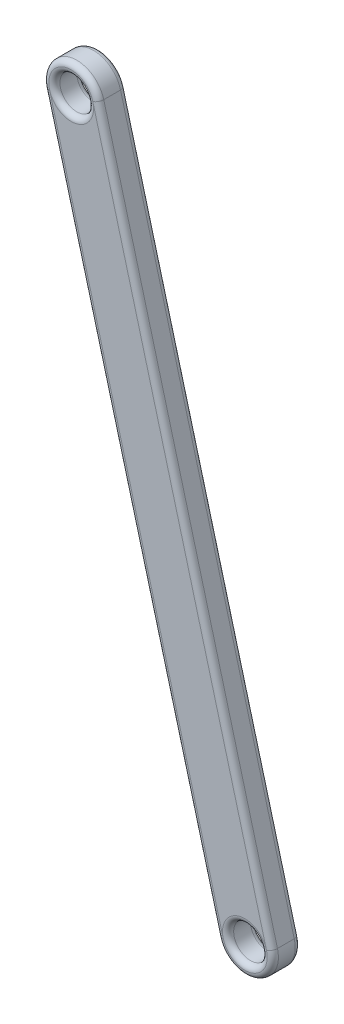
ISO-10303-21;
HEADER;
FILE_DESCRIPTION(('STEP AP214'),'2;1');
FILE_NAME('part.step','',(''),(''),'','','');
FILE_SCHEMA(('AUTOMOTIVE_DESIGN { 1 0 10303 214 1 1 1 1 }'));
ENDSEC;
DATA;
#1=APPLICATION_CONTEXT('core data for automotive mechanical design processes');
#2=APPLICATION_PROTOCOL_DEFINITION('international standard','automotive_design',2000,#1);
#3=PRODUCT_CONTEXT('',#1,'mechanical');
#4=PRODUCT('Part','Part','',(#3));
#5=PRODUCT_RELATED_PRODUCT_CATEGORY('part','',(#4));
#6=PRODUCT_DEFINITION_FORMATION('','',#4);
#7=PRODUCT_DEFINITION_CONTEXT('part definition',#1,'design');
#8=PRODUCT_DEFINITION('design','',#6,#7);
#9=PRODUCT_DEFINITION_SHAPE('','',#8);
#10=(LENGTH_UNIT() NAMED_UNIT(*) SI_UNIT(.MILLI.,.METRE.));
#11=(NAMED_UNIT(*) PLANE_ANGLE_UNIT() SI_UNIT($,.RADIAN.));
#12=(NAMED_UNIT(*) SI_UNIT($,.STERADIAN.) SOLID_ANGLE_UNIT());
#13=UNCERTAINTY_MEASURE_WITH_UNIT(LENGTH_MEASURE(1.E-05),#10,'distance_accuracy_value','');
#14=(GEOMETRIC_REPRESENTATION_CONTEXT(3) GLOBAL_UNCERTAINTY_ASSIGNED_CONTEXT((#13)) GLOBAL_UNIT_ASSIGNED_CONTEXT((#10,
#11,#12)) REPRESENTATION_CONTEXT('',''));
#15=CARTESIAN_POINT('',(0.,0.,0.));
#16=DIRECTION('',(0.,0.,1.));
#17=DIRECTION('',(1.,0.,0.));
#18=AXIS2_PLACEMENT_3D('',#15,#16,#17);
#19=CARTESIAN_POINT('',(27.373714942326,121.762953497462,2.5));
#20=DIRECTION('',(0.,0.,1.));
#21=DIRECTION('',(1.,0.,0.));
#22=AXIS2_PLACEMENT_3D('',#19,#20,#21);
#23=PLANE('',#22);
#24=DIRECTION('',(0.258819045102528,-0.965925826289067,0.));
#25=VECTOR('',#24,1.);
#26=CARTESIAN_POINT('',(40.9710059958995,63.2897658299125,2.5));
#27=LINE('',#26,#25);
#28=CARTESIAN_POINT('',(25.4418632897479,121.245315407256,2.5));
#29=VERTEX_POINT('',#28);
#30=CARTESIAN_POINT('',(40.9710059958995,63.2897658299125,2.5));
#31=VERTEX_POINT('',#30);
#32=EDGE_CURVE('E64',#29,#31,#27,.T.);
#33=ORIENTED_EDGE('',*,*,#32,.T.);
#34=CARTESIAN_POINT('',(42.9028576484777,63.8074039201176,2.5));
#35=DIRECTION('',(0.,0.,1.));
#36=DIRECTION('',(1.,0.,0.));
#37=AXIS2_PLACEMENT_3D('',#34,#35,#36);
#38=CIRCLE('',#37,2.);
#39=CARTESIAN_POINT('',(44.8347093010558,64.3250420103226,2.5));
#40=VERTEX_POINT('',#39);
#41=EDGE_CURVE('E11',#31,#40,#38,.F.);
#42=ORIENTED_EDGE('',*,*,#41,.T.);
#43=DIRECTION('',(-0.258819045102528,0.965925826289067,0.));
#44=VECTOR('',#43,1.);
#45=CARTESIAN_POINT('',(29.3055665949042,122.280591587667,2.5));
#46=LINE('',#45,#44);
#47=CARTESIAN_POINT('',(29.3055665949042,122.280591587667,2.5));
#48=VERTEX_POINT('',#47);
#49=EDGE_CURVE('E50',#40,#48,#46,.T.);
#50=ORIENTED_EDGE('',*,*,#49,.T.);
#51=CARTESIAN_POINT('',(27.373714942326,121.762953497462,2.5));
#52=DIRECTION('',(0.,0.,1.));
#53=DIRECTION('',(1.,0.,0.));
#54=AXIS2_PLACEMENT_3D('',#51,#52,#53);
#55=CIRCLE('',#54,2.00000000000001);
#56=CARTESIAN_POINT('',(29.373714942326,121.762953497462,2.5));
#57=VERTEX_POINT('',#56);
#58=EDGE_CURVE('E189',#48,#57,#55,.F.);
#59=ORIENTED_EDGE('',*,*,#58,.T.);
#60=CARTESIAN_POINT('',(27.373714942326,121.762953497462,2.5));
#61=DIRECTION('',(0.,0.,1.));
#62=DIRECTION('',(1.,0.,0.));
#63=AXIS2_PLACEMENT_3D('',#60,#61,#62);
#64=CIRCLE('',#63,2.00000000000001);
#65=EDGE_CURVE('E191',#57,#29,#64,.F.);
#66=ORIENTED_EDGE('',*,*,#65,.T.);
#67=EDGE_LOOP('',(#33,#42,#50,#59,#66));
#68=FACE_BOUND('',#67,.T.);
#69=ADVANCED_FACE('F41',(#68),#23,.T.);
#70=CARTESIAN_POINT('',(27.373714942326,121.762953497462,0.));
#71=DIRECTION('',(0.,0.,1.));
#72=DIRECTION('',(1.,0.,0.));
#73=AXIS2_PLACEMENT_3D('',#70,#71,#72);
#74=PLANE('',#73);
#75=DIRECTION('',(0.258819045102528,-0.965925826289067,0.));
#76=VECTOR('',#75,1.);
#77=CARTESIAN_POINT('',(25.4418632897479,121.245315407257,0.));
#78=LINE('',#77,#76);
#79=CARTESIAN_POINT('',(40.9710059958995,63.2897658299125,0.));
#80=VERTEX_POINT('',#79);
#81=CARTESIAN_POINT('',(25.4418632897479,121.245315407256,0.));
#82=VERTEX_POINT('',#81);
#83=EDGE_CURVE('E157',#80,#82,#78,.F.);
#84=ORIENTED_EDGE('',*,*,#83,.T.);
#85=CARTESIAN_POINT('',(27.373714942326,121.762953497462,0.));
#86=DIRECTION('',(0.,0.,1.));
#87=DIRECTION('',(1.,0.,0.));
#88=AXIS2_PLACEMENT_3D('',#85,#86,#87);
#89=CIRCLE('',#88,2.00000000000001);
#90=CARTESIAN_POINT('',(29.373714942326,121.762953497462,0.));
#91=VERTEX_POINT('',#90);
#92=EDGE_CURVE('E122',#82,#91,#89,.T.);
#93=ORIENTED_EDGE('',*,*,#92,.T.);
#94=CARTESIAN_POINT('',(27.373714942326,121.762953497462,0.));
#95=DIRECTION('',(0.,0.,1.));
#96=DIRECTION('',(1.,0.,0.));
#97=AXIS2_PLACEMENT_3D('',#94,#95,#96);
#98=CIRCLE('',#97,2.00000000000001);
#99=CARTESIAN_POINT('',(29.3055665949041,122.280591587667,0.));
#100=VERTEX_POINT('',#99);
#101=EDGE_CURVE('E114',#91,#100,#98,.T.);
#102=ORIENTED_EDGE('',*,*,#101,.T.);
#103=DIRECTION('',(-0.258819045102528,0.965925826289067,0.));
#104=VECTOR('',#103,1.);
#105=CARTESIAN_POINT('',(29.3055665949041,122.280591587667,0.));
#106=LINE('',#105,#104);
#107=CARTESIAN_POINT('',(44.8347093010558,64.3250420103226,0.));
#108=VERTEX_POINT('',#107);
#109=EDGE_CURVE('E119',#100,#108,#106,.F.);
#110=ORIENTED_EDGE('',*,*,#109,.T.);
#111=CARTESIAN_POINT('',(42.9028576484777,63.8074039201176,0.));
#112=DIRECTION('',(0.,0.,1.));
#113=DIRECTION('',(1.,0.,0.));
#114=AXIS2_PLACEMENT_3D('',#111,#112,#113);
#115=CIRCLE('',#114,2.);
#116=EDGE_CURVE('E124',#108,#80,#115,.T.);
#117=ORIENTED_EDGE('',*,*,#116,.T.);
#118=EDGE_LOOP('',(#84,#93,#102,#110,#117));
#119=FACE_BOUND('',#118,.T.);
#120=ADVANCED_FACE('F116',(#119),#74,.F.);
#121=CARTESIAN_POINT('',(27.373714942326,121.762953497462,2.5));
#122=DIRECTION('',(0.,0.,-1.));
#123=DIRECTION('',(-1.,0.,0.));
#124=AXIS2_PLACEMENT_3D('',#121,#122,#123);
#125=CYLINDRICAL_SURFACE('',#124,2.5);
#126=DIRECTION('',(0.,0.,-1.));
#127=VECTOR('',#126,1.);
#128=CARTESIAN_POINT('',(29.7885295080487,122.410001110218,2.5));
#129=LINE('',#128,#127);
#130=CARTESIAN_POINT('',(29.7885295080487,122.410001110218,2.));
#131=VERTEX_POINT('',#130);
#132=CARTESIAN_POINT('',(29.7885295080487,122.410001110218,0.5));
#133=VERTEX_POINT('',#132);
#134=EDGE_CURVE('E133',#131,#133,#129,.T.);
#135=ORIENTED_EDGE('',*,*,#134,.T.);
#136=CARTESIAN_POINT('',(27.373714942326,121.762953497462,0.5));
#137=DIRECTION('',(0.,0.,1.));
#138=DIRECTION('',(1.,0.,0.));
#139=AXIS2_PLACEMENT_3D('',#136,#137,#138);
#140=CIRCLE('',#139,2.5);
#141=CARTESIAN_POINT('',(24.9589003766033,121.115905884705,0.5));
#142=VERTEX_POINT('',#141);
#143=EDGE_CURVE('E140',#133,#142,#140,.T.);
#144=ORIENTED_EDGE('',*,*,#143,.T.);
#145=DIRECTION('',(0.,0.,-1.));
#146=VECTOR('',#145,1.);
#147=CARTESIAN_POINT('',(24.9589003766033,121.115905884705,2.5));
#148=LINE('',#147,#146);
#149=CARTESIAN_POINT('',(24.9589003766033,121.115905884705,2.));
#150=VERTEX_POINT('',#149);
#151=EDGE_CURVE('E149',#150,#142,#148,.T.);
#152=ORIENTED_EDGE('',*,*,#151,.F.);
#153=CARTESIAN_POINT('',(27.373714942326,121.762953497462,2.));
#154=DIRECTION('',(0.,0.,1.));
#155=DIRECTION('',(1.,0.,0.));
#156=AXIS2_PLACEMENT_3D('',#153,#154,#155);
#157=CIRCLE('',#156,2.5);
#158=EDGE_CURVE('E186',#150,#131,#157,.F.);
#159=ORIENTED_EDGE('',*,*,#158,.T.);
#160=EDGE_LOOP('',(#135,#144,#152,#159));
#161=FACE_BOUND('',#160,.T.);
#162=ADVANCED_FACE('F241',(#161),#125,.T.);
#163=CARTESIAN_POINT('',(24.9589003766033,121.115905884705,2.5));
#164=DIRECTION('',(0.965925826289067,0.258819045102528,0.));
#165=DIRECTION('',(-0.258819045102528,0.965925826289067,0.));
#166=AXIS2_PLACEMENT_3D('',#163,#164,#165);
#167=PLANE('',#166);
#168=ORIENTED_EDGE('',*,*,#151,.T.);
#169=DIRECTION('',(0.258819045102528,-0.965925826289067,0.));
#170=VECTOR('',#169,1.);
#171=CARTESIAN_POINT('',(24.9589003766033,121.115905884705,0.5));
#172=LINE('',#171,#170);
#173=CARTESIAN_POINT('',(40.488043082755,63.1603563073612,0.5));
#174=VERTEX_POINT('',#173);
#175=EDGE_CURVE('E174',#142,#174,#172,.T.);
#176=ORIENTED_EDGE('',*,*,#175,.T.);
#177=DIRECTION('',(0.,0.,-1.));
#178=VECTOR('',#177,1.);
#179=CARTESIAN_POINT('',(40.488043082755,63.1603563073612,2.5));
#180=LINE('',#179,#178);
#181=CARTESIAN_POINT('',(40.488043082755,63.1603563073612,2.));
#182=VERTEX_POINT('',#181);
#183=EDGE_CURVE('E152',#182,#174,#180,.T.);
#184=ORIENTED_EDGE('',*,*,#183,.F.);
#185=DIRECTION('',(0.258819045102528,-0.965925826289067,0.));
#186=VECTOR('',#185,1.);
#187=CARTESIAN_POINT('',(24.9589003766033,121.115905884705,2.));
#188=LINE('',#187,#186);
#189=EDGE_CURVE('E172',#182,#150,#188,.F.);
#190=ORIENTED_EDGE('',*,*,#189,.T.);
#191=EDGE_LOOP('',(#168,#176,#184,#190));
#192=FACE_BOUND('',#191,.T.);
#193=ADVANCED_FACE('F277',(#192),#167,.F.);
#194=CARTESIAN_POINT('',(42.9028576484777,63.8074039201176,2.5));
#195=DIRECTION('',(0.,0.,-1.));
#196=DIRECTION('',(-1.,0.,0.));
#197=AXIS2_PLACEMENT_3D('',#194,#195,#196);
#198=CYLINDRICAL_SURFACE('',#197,2.50000000000002);
#199=ORIENTED_EDGE('',*,*,#183,.T.);
#200=CARTESIAN_POINT('',(42.9028576484777,63.8074039201176,0.5));
#201=DIRECTION('',(0.,0.,1.));
#202=DIRECTION('',(1.,0.,0.));
#203=AXIS2_PLACEMENT_3D('',#200,#201,#202);
#204=CIRCLE('',#203,2.50000000000002);
#205=CARTESIAN_POINT('',(45.3176722142004,64.4544515328739,0.5));
#206=VERTEX_POINT('',#205);
#207=EDGE_CURVE('E179',#174,#206,#204,.T.);
#208=ORIENTED_EDGE('',*,*,#207,.T.);
#209=DIRECTION('',(0.,0.,-1.));
#210=VECTOR('',#209,1.);
#211=CARTESIAN_POINT('',(45.3176722142004,64.4544515328739,2.5));
#212=LINE('',#211,#210);
#213=CARTESIAN_POINT('',(45.3176722142004,64.4544515328739,2.));
#214=VERTEX_POINT('',#213);
#215=EDGE_CURVE('E232',#214,#206,#212,.T.);
#216=ORIENTED_EDGE('',*,*,#215,.F.);
#217=CARTESIAN_POINT('',(42.9028576484777,63.8074039201176,2.));
#218=DIRECTION('',(0.,0.,1.));
#219=DIRECTION('',(1.,0.,0.));
#220=AXIS2_PLACEMENT_3D('',#217,#218,#219);
#221=CIRCLE('',#220,2.50000000000002);
#222=EDGE_CURVE('E177',#214,#182,#221,.F.);
#223=ORIENTED_EDGE('',*,*,#222,.T.);
#224=EDGE_LOOP('',(#199,#208,#216,#223));
#225=FACE_BOUND('',#224,.T.);
#226=ADVANCED_FACE('F236',(#225),#198,.T.);
#227=CARTESIAN_POINT('',(29.7885295080487,122.410001110218,2.5));
#228=DIRECTION('',(-0.965925826289066,-0.258819045102528,0.));
#229=DIRECTION('',(0.258819045102528,-0.965925826289067,0.));
#230=AXIS2_PLACEMENT_3D('',#227,#228,#229);
#231=PLANE('',#230);
#232=ORIENTED_EDGE('',*,*,#215,.T.);
#233=DIRECTION('',(-0.258819045102528,0.965925826289067,0.));
#234=VECTOR('',#233,1.);
#235=CARTESIAN_POINT('',(29.7885295080487,122.410001110218,0.5));
#236=LINE('',#235,#234);
#237=EDGE_CURVE('E184',#206,#133,#236,.T.);
#238=ORIENTED_EDGE('',*,*,#237,.T.);
#239=ORIENTED_EDGE('',*,*,#134,.F.);
#240=DIRECTION('',(-0.258819045102528,0.965925826289067,0.));
#241=VECTOR('',#240,1.);
#242=CARTESIAN_POINT('',(45.3176722142004,64.4544515328739,2.));
#243=LINE('',#242,#241);
#244=EDGE_CURVE('E181',#131,#214,#243,.F.);
#245=ORIENTED_EDGE('',*,*,#244,.T.);
#246=EDGE_LOOP('',(#232,#238,#239,#245));
#247=FACE_BOUND('',#246,.T.);
#248=ADVANCED_FACE('F231',(#247),#231,.F.);
#249=CARTESIAN_POINT('',(27.373714942326,121.762953497462,2.5));
#250=DIRECTION('',(0.,0.,-1.));
#251=DIRECTION('',(-1.,0.,0.));
#252=AXIS2_PLACEMENT_3D('',#249,#250,#251);
#253=CYLINDRICAL_SURFACE('',#252,1.50000000000001);
#254=CARTESIAN_POINT('',(27.373714942326,121.762953497462,0.5));
#255=DIRECTION('',(0.,0.,1.));
#256=DIRECTION('',(1.,0.,0.));
#257=AXIS2_PLACEMENT_3D('',#254,#255,#256);
#258=CIRCLE('',#257,1.50000000000001);
#259=CARTESIAN_POINT('',(28.873714942326,121.762953497462,0.5));
#260=VERTEX_POINT('',#259);
#261=EDGE_CURVE('E169',#260,#260,#258,.F.);
#262=ORIENTED_EDGE('',*,*,#261,.T.);
#263=EDGE_LOOP('',(#262));
#264=FACE_BOUND('',#263,.T.);
#265=CARTESIAN_POINT('',(27.373714942326,121.762953497462,2.));
#266=DIRECTION('',(0.,0.,1.));
#267=DIRECTION('',(1.,0.,0.));
#268=AXIS2_PLACEMENT_3D('',#265,#266,#267);
#269=CIRCLE('',#268,1.50000000000001);
#270=CARTESIAN_POINT('',(28.873714942326,121.762953497462,2.));
#271=VERTEX_POINT('',#270);
#272=EDGE_CURVE('E166',#271,#271,#269,.T.);
#273=ORIENTED_EDGE('',*,*,#272,.T.);
#274=EDGE_LOOP('',(#273));
#275=FACE_BOUND('',#274,.T.);
#276=ADVANCED_FACE('F255',(#264,#275),#253,.F.);
#277=CARTESIAN_POINT('',(42.9028576484777,63.8074039201176,2.5));
#278=DIRECTION('',(0.,0.,-1.));
#279=DIRECTION('',(-1.,0.,0.));
#280=AXIS2_PLACEMENT_3D('',#277,#278,#279);
#281=CYLINDRICAL_SURFACE('',#280,1.5);
#282=CARTESIAN_POINT('',(42.9028576484777,63.8074039201176,0.5));
#283=DIRECTION('',(0.,0.,1.));
#284=DIRECTION('',(1.,0.,0.));
#285=AXIS2_PLACEMENT_3D('',#282,#283,#284);
#286=CIRCLE('',#285,1.5);
#287=CARTESIAN_POINT('',(44.4028576484777,63.8074039201176,0.5));
#288=VERTEX_POINT('',#287);
#289=EDGE_CURVE('E163',#288,#288,#286,.F.);
#290=ORIENTED_EDGE('',*,*,#289,.T.);
#291=EDGE_LOOP('',(#290));
#292=FACE_BOUND('',#291,.T.);
#293=CARTESIAN_POINT('',(42.9028576484777,63.8074039201176,2.));
#294=DIRECTION('',(0.,0.,1.));
#295=DIRECTION('',(1.,0.,0.));
#296=AXIS2_PLACEMENT_3D('',#293,#294,#295);
#297=CIRCLE('',#296,1.5);
#298=CARTESIAN_POINT('',(44.4028576484777,63.8074039201176,2.));
#299=VERTEX_POINT('',#298);
#300=EDGE_CURVE('E160',#299,#299,#297,.T.);
#301=ORIENTED_EDGE('',*,*,#300,.T.);
#302=EDGE_LOOP('',(#301));
#303=FACE_BOUND('',#302,.T.);
#304=ADVANCED_FACE('F253',(#292,#303),#281,.F.);
#305=CARTESIAN_POINT('',(27.373714942326,121.762953497462,0.5));
#306=DIRECTION('',(0.,0.,1.));
#307=DIRECTION('',(1.,0.,0.));
#308=AXIS2_PLACEMENT_3D('',#305,#306,#307);
#309=TOROIDAL_SURFACE('',#308,2.00000000000001,0.5);
#310=ORIENTED_EDGE('',*,*,#261,.F.);
#311=EDGE_LOOP('',(#310));
#312=FACE_BOUND('',#311,.T.);
#313=CARTESIAN_POINT('',(27.373714942326,121.762953497462,0.));
#314=DIRECTION('',(0.,0.,1.));
#315=DIRECTION('',(1.,0.,0.));
#316=AXIS2_PLACEMENT_3D('',#313,#314,#315);
#317=CIRCLE('',#316,2.00000000000001);
#318=EDGE_CURVE('E127',#100,#82,#317,.T.);
#319=ORIENTED_EDGE('',*,*,#318,.F.);
#320=ORIENTED_EDGE('',*,*,#101,.F.);
#321=ORIENTED_EDGE('',*,*,#92,.F.);
#322=EDGE_LOOP('',(#319,#320,#321));
#323=FACE_BOUND('',#322,.T.);
#324=ADVANCED_FACE('F129',(#312,#323),#309,.T.);
#325=CARTESIAN_POINT('',(27.373714942326,121.762953497462,0.5));
#326=DIRECTION('',(0.,0.,1.));
#327=DIRECTION('',(1.,0.,0.));
#328=AXIS2_PLACEMENT_3D('',#325,#326,#327);
#329=TOROIDAL_SURFACE('',#328,2.,0.5);
#330=CARTESIAN_POINT('',(29.3055665949042,122.280591587667,0.5));
#331=DIRECTION('',(0.258819045102527,-0.965925826289067,0.));
#332=DIRECTION('',(0.965925826289067,0.258819045102527,0.));
#333=AXIS2_PLACEMENT_3D('',#330,#331,#332);
#334=CIRCLE('',#333,0.5);
#335=EDGE_CURVE('E138',#100,#133,#334,.T.);
#336=ORIENTED_EDGE('',*,*,#335,.F.);
#337=ORIENTED_EDGE('',*,*,#318,.T.);
#338=CARTESIAN_POINT('',(25.4418632897479,121.245315407256,0.5));
#339=DIRECTION('',(0.258819045102527,-0.965925826289067,0.));
#340=DIRECTION('',(0.965925826289067,0.258819045102527,0.));
#341=AXIS2_PLACEMENT_3D('',#338,#339,#340);
#342=CIRCLE('',#341,0.5);
#343=EDGE_CURVE('E134',#142,#82,#342,.T.);
#344=ORIENTED_EDGE('',*,*,#343,.F.);
#345=ORIENTED_EDGE('',*,*,#143,.F.);
#346=EDGE_LOOP('',(#336,#337,#344,#345));
#347=FACE_BOUND('',#346,.T.);
#348=ADVANCED_FACE('F139',(#347),#329,.T.);
#349=CARTESIAN_POINT('',(25.4418632897479,121.245315407256,0.5));
#350=DIRECTION('',(0.258819045102528,-0.965925826289067,0.));
#351=DIRECTION('',(0.965925826289067,0.258819045102528,0.));
#352=AXIS2_PLACEMENT_3D('',#349,#350,#351);
#353=CYLINDRICAL_SURFACE('',#352,0.5);
#354=ORIENTED_EDGE('',*,*,#343,.T.);
#355=ORIENTED_EDGE('',*,*,#83,.F.);
#356=CARTESIAN_POINT('',(40.9710059958995,63.2897658299125,0.5));
#357=DIRECTION('',(0.258819045102525,-0.965925826289067,0.));
#358=DIRECTION('',(0.965925826289067,0.258819045102525,0.));
#359=AXIS2_PLACEMENT_3D('',#356,#357,#358);
#360=CIRCLE('',#359,0.5);
#361=EDGE_CURVE('E143',#174,#80,#360,.T.);
#362=ORIENTED_EDGE('',*,*,#361,.F.);
#363=ORIENTED_EDGE('',*,*,#175,.F.);
#364=EDGE_LOOP('',(#354,#355,#362,#363));
#365=FACE_BOUND('',#364,.T.);
#366=ADVANCED_FACE('F293',(#365),#353,.T.);
#367=CARTESIAN_POINT('',(29.3055665949042,122.280591587667,0.5));
#368=DIRECTION('',(-0.258819045102528,0.965925826289067,0.));
#369=DIRECTION('',(-0.965925826289066,-0.258819045102528,0.));
#370=AXIS2_PLACEMENT_3D('',#367,#368,#369);
#371=CYLINDRICAL_SURFACE('',#370,0.5);
#372=ORIENTED_EDGE('',*,*,#335,.T.);
#373=ORIENTED_EDGE('',*,*,#237,.F.);
#374=CARTESIAN_POINT('',(44.8347093010558,64.3250420103226,0.5));
#375=DIRECTION('',(0.258819045102525,-0.965925826289067,0.));
#376=DIRECTION('',(0.965925826289067,0.258819045102525,0.));
#377=AXIS2_PLACEMENT_3D('',#374,#375,#376);
#378=CIRCLE('',#377,0.5);
#379=EDGE_CURVE('E147',#108,#206,#378,.T.);
#380=ORIENTED_EDGE('',*,*,#379,.F.);
#381=ORIENTED_EDGE('',*,*,#109,.F.);
#382=EDGE_LOOP('',(#372,#373,#380,#381));
#383=FACE_BOUND('',#382,.T.);
#384=ADVANCED_FACE('F145',(#383),#371,.T.);
#385=CARTESIAN_POINT('',(42.9028576484777,63.8074039201176,0.5));
#386=DIRECTION('',(0.,0.,1.));
#387=DIRECTION('',(1.,0.,0.));
#388=AXIS2_PLACEMENT_3D('',#385,#386,#387);
#389=TOROIDAL_SURFACE('',#388,2.00000000000002,0.5);
#390=CARTESIAN_POINT('',(42.9028576484777,63.8074039201176,0.));
#391=DIRECTION('',(0.,0.,1.));
#392=DIRECTION('',(1.,0.,0.));
#393=AXIS2_PLACEMENT_3D('',#390,#391,#392);
#394=CIRCLE('',#393,2.00000000000002);
#395=EDGE_CURVE('E195',#108,#80,#394,.F.);
#396=ORIENTED_EDGE('',*,*,#395,.F.);
#397=ORIENTED_EDGE('',*,*,#379,.T.);
#398=ORIENTED_EDGE('',*,*,#207,.F.);
#399=ORIENTED_EDGE('',*,*,#361,.T.);
#400=EDGE_LOOP('',(#396,#397,#398,#399));
#401=FACE_BOUND('',#400,.T.);
#402=ADVANCED_FACE('F286',(#401),#389,.T.);
#403=CARTESIAN_POINT('',(42.9028576484777,63.8074039201176,0.5));
#404=DIRECTION('',(0.,0.,1.));
#405=DIRECTION('',(1.,0.,0.));
#406=AXIS2_PLACEMENT_3D('',#403,#404,#405);
#407=TOROIDAL_SURFACE('',#406,2.,0.5);
#408=ORIENTED_EDGE('',*,*,#289,.F.);
#409=EDGE_LOOP('',(#408));
#410=FACE_BOUND('',#409,.T.);
#411=ORIENTED_EDGE('',*,*,#116,.F.);
#412=ORIENTED_EDGE('',*,*,#395,.T.);
#413=EDGE_LOOP('',(#411,#412));
#414=FACE_BOUND('',#413,.T.);
#415=ADVANCED_FACE('F283',(#410,#414),#407,.T.);
#416=CARTESIAN_POINT('',(27.373714942326,121.762953497462,2.));
#417=DIRECTION('',(0.,0.,1.));
#418=DIRECTION('',(1.,0.,0.));
#419=AXIS2_PLACEMENT_3D('',#416,#417,#418);
#420=TOROIDAL_SURFACE('',#419,2.00000000000001,0.5);
#421=ORIENTED_EDGE('',*,*,#272,.F.);
#422=EDGE_LOOP('',(#421));
#423=FACE_BOUND('',#422,.T.);
#424=CARTESIAN_POINT('',(27.373714942326,121.762953497462,2.5));
#425=DIRECTION('',(0.,0.,1.));
#426=DIRECTION('',(1.,0.,0.));
#427=AXIS2_PLACEMENT_3D('',#424,#425,#426);
#428=CIRCLE('',#427,2.00000000000001);
#429=EDGE_CURVE('E45',#29,#48,#428,.F.);
#430=ORIENTED_EDGE('',*,*,#429,.F.);
#431=ORIENTED_EDGE('',*,*,#65,.F.);
#432=ORIENTED_EDGE('',*,*,#58,.F.);
#433=EDGE_LOOP('',(#430,#431,#432));
#434=FACE_BOUND('',#433,.T.);
#435=ADVANCED_FACE('F43',(#423,#434),#420,.T.);
#436=CARTESIAN_POINT('',(27.373714942326,121.762953497462,2.));
#437=DIRECTION('',(0.,0.,1.));
#438=DIRECTION('',(1.,0.,0.));
#439=AXIS2_PLACEMENT_3D('',#436,#437,#438);
#440=TOROIDAL_SURFACE('',#439,2.,0.5);
#441=CARTESIAN_POINT('',(25.4418632897479,121.245315407256,2.));
#442=DIRECTION('',(0.258819045102527,-0.965925826289067,0.));
#443=DIRECTION('',(0.965925826289067,0.258819045102527,0.));
#444=AXIS2_PLACEMENT_3D('',#441,#442,#443);
#445=CIRCLE('',#444,0.5);
#446=EDGE_CURVE('E207',#29,#150,#445,.T.);
#447=ORIENTED_EDGE('',*,*,#446,.F.);
#448=ORIENTED_EDGE('',*,*,#429,.T.);
#449=CARTESIAN_POINT('',(29.3055665949042,122.280591587667,2.));
#450=DIRECTION('',(0.258819045102527,-0.965925826289067,0.));
#451=DIRECTION('',(0.965925826289067,0.258819045102527,0.));
#452=AXIS2_PLACEMENT_3D('',#449,#450,#451);
#453=CIRCLE('',#452,0.5);
#454=EDGE_CURVE('E209',#131,#48,#453,.T.);
#455=ORIENTED_EDGE('',*,*,#454,.F.);
#456=ORIENTED_EDGE('',*,*,#158,.F.);
#457=EDGE_LOOP('',(#447,#448,#455,#456));
#458=FACE_BOUND('',#457,.T.);
#459=ADVANCED_FACE('F219',(#458),#440,.T.);
#460=CARTESIAN_POINT('',(29.3055665949042,122.280591587667,2.));
#461=DIRECTION('',(0.258819045102528,-0.965925826289067,0.));
#462=DIRECTION('',(0.965925826289066,0.258819045102528,0.));
#463=AXIS2_PLACEMENT_3D('',#460,#461,#462);
#464=CYLINDRICAL_SURFACE('',#463,0.5);
#465=ORIENTED_EDGE('',*,*,#454,.T.);
#466=ORIENTED_EDGE('',*,*,#49,.F.);
#467=CARTESIAN_POINT('',(44.8347093010558,64.3250420103226,2.));
#468=DIRECTION('',(0.258819045102525,-0.965925826289067,0.));
#469=DIRECTION('',(0.965925826289067,0.258819045102525,0.));
#470=AXIS2_PLACEMENT_3D('',#467,#468,#469);
#471=CIRCLE('',#470,0.5);
#472=EDGE_CURVE('E205',#214,#40,#471,.T.);
#473=ORIENTED_EDGE('',*,*,#472,.F.);
#474=ORIENTED_EDGE('',*,*,#244,.F.);
#475=EDGE_LOOP('',(#465,#466,#473,#474));
#476=FACE_BOUND('',#475,.T.);
#477=ADVANCED_FACE('F225',(#476),#464,.T.);
#478=CARTESIAN_POINT('',(25.4418632897479,121.245315407257,2.));
#479=DIRECTION('',(-0.258819045102528,0.965925826289067,0.));
#480=DIRECTION('',(-0.965925826289067,-0.258819045102528,0.));
#481=AXIS2_PLACEMENT_3D('',#478,#479,#480);
#482=CYLINDRICAL_SURFACE('',#481,0.5);
#483=ORIENTED_EDGE('',*,*,#446,.T.);
#484=ORIENTED_EDGE('',*,*,#189,.F.);
#485=CARTESIAN_POINT('',(40.9710059958995,63.2897658299125,2.));
#486=DIRECTION('',(0.258819045102525,-0.965925826289067,0.));
#487=DIRECTION('',(0.965925826289067,0.258819045102525,0.));
#488=AXIS2_PLACEMENT_3D('',#485,#486,#487);
#489=CIRCLE('',#488,0.5);
#490=EDGE_CURVE('E202',#31,#182,#489,.T.);
#491=ORIENTED_EDGE('',*,*,#490,.F.);
#492=ORIENTED_EDGE('',*,*,#32,.F.);
#493=EDGE_LOOP('',(#483,#484,#491,#492));
#494=FACE_BOUND('',#493,.T.);
#495=ADVANCED_FACE('F245',(#494),#482,.T.);
#496=CARTESIAN_POINT('',(42.9028576484777,63.8074039201176,2.));
#497=DIRECTION('',(0.,0.,1.));
#498=DIRECTION('',(1.,0.,0.));
#499=AXIS2_PLACEMENT_3D('',#496,#497,#498);
#500=TOROIDAL_SURFACE('',#499,2.00000000000002,0.5);
#501=CARTESIAN_POINT('',(42.9028576484777,63.8074039201176,2.5));
#502=DIRECTION('',(0.,0.,1.));
#503=DIRECTION('',(1.,0.,0.));
#504=AXIS2_PLACEMENT_3D('',#501,#502,#503);
#505=CIRCLE('',#504,2.00000000000002);
#506=EDGE_CURVE('E57',#31,#40,#505,.T.);
#507=ORIENTED_EDGE('',*,*,#506,.F.);
#508=ORIENTED_EDGE('',*,*,#490,.T.);
#509=ORIENTED_EDGE('',*,*,#222,.F.);
#510=ORIENTED_EDGE('',*,*,#472,.T.);
#511=EDGE_LOOP('',(#507,#508,#509,#510));
#512=FACE_BOUND('',#511,.T.);
#513=ADVANCED_FACE('F246',(#512),#500,.T.);
#514=CARTESIAN_POINT('',(42.9028576484777,63.8074039201176,2.));
#515=DIRECTION('',(0.,0.,1.));
#516=DIRECTION('',(1.,0.,0.));
#517=AXIS2_PLACEMENT_3D('',#514,#515,#516);
#518=TOROIDAL_SURFACE('',#517,2.,0.5);
#519=ORIENTED_EDGE('',*,*,#41,.F.);
#520=ORIENTED_EDGE('',*,*,#506,.T.);
#521=EDGE_LOOP('',(#519,#520));
#522=FACE_BOUND('',#521,.T.);
#523=ORIENTED_EDGE('',*,*,#300,.F.);
#524=EDGE_LOOP('',(#523));
#525=FACE_BOUND('',#524,.T.);
#526=ADVANCED_FACE('F247',(#522,#525),#518,.T.);
#527=CLOSED_SHELL('',(#69,#120,#162,#193,#226,#248,#276,#304,#324,#348,#366,#384,#402,#415,#435,
#459,#477,#495,#513,#526));
#528=MANIFOLD_SOLID_BREP('B2',#527);
#529=ADVANCED_BREP_SHAPE_REPRESENTATION('',(#18,#528),#14);
#530=SHAPE_DEFINITION_REPRESENTATION(#9,#529);
ENDSEC;
END-ISO-10303-21;
